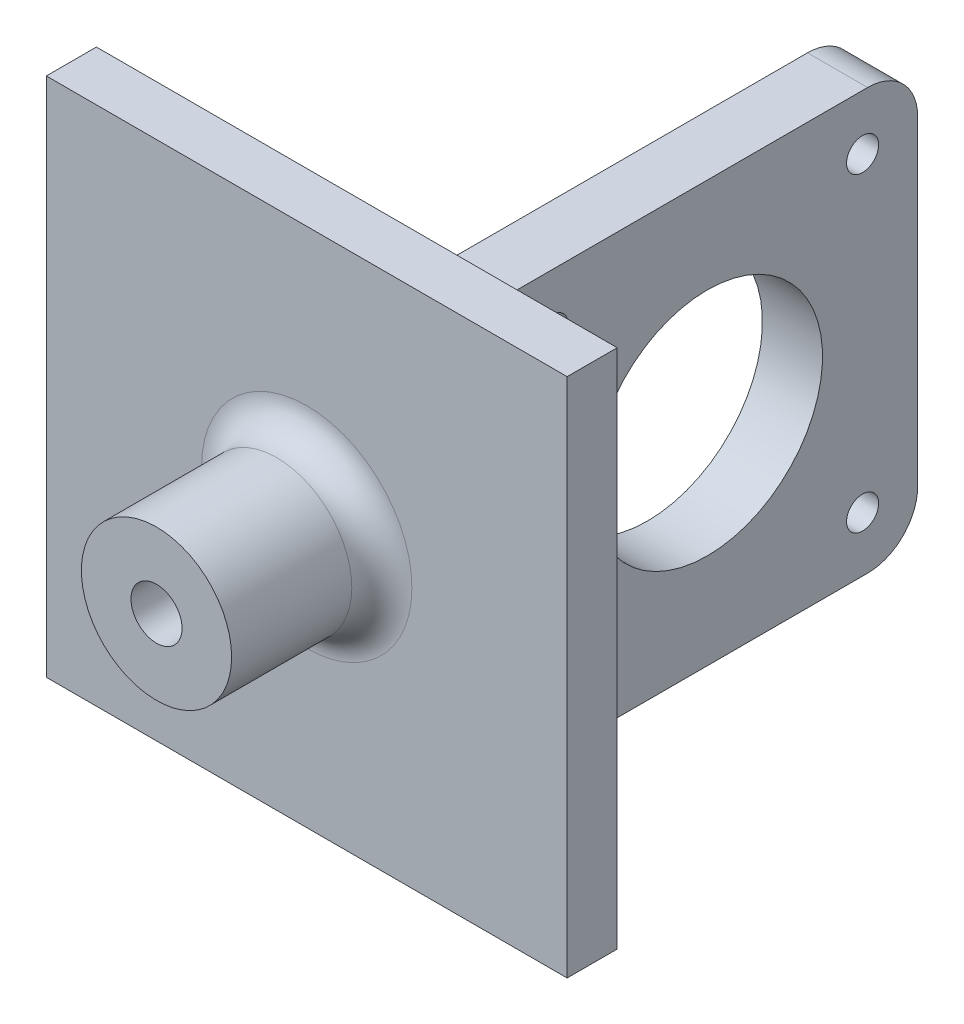
ISO-10303-21;
HEADER;
FILE_DESCRIPTION(('STEP AP214'),'2;1');
FILE_NAME('part.step','',(''),(''),'','','');
FILE_SCHEMA(('AUTOMOTIVE_DESIGN { 1 0 10303 214 1 1 1 1 }'));
ENDSEC;
DATA;
#1=APPLICATION_CONTEXT('core data for automotive mechanical design processes');
#2=APPLICATION_PROTOCOL_DEFINITION('international standard','automotive_design',2000,#1);
#3=PRODUCT_CONTEXT('',#1,'mechanical');
#4=PRODUCT('Part','Part','',(#3));
#5=PRODUCT_RELATED_PRODUCT_CATEGORY('part','',(#4));
#6=PRODUCT_DEFINITION_FORMATION('','',#4);
#7=PRODUCT_DEFINITION_CONTEXT('part definition',#1,'design');
#8=PRODUCT_DEFINITION('design','',#6,#7);
#9=PRODUCT_DEFINITION_SHAPE('','',#8);
#10=(LENGTH_UNIT() NAMED_UNIT(*) SI_UNIT(.MILLI.,.METRE.));
#11=(NAMED_UNIT(*) PLANE_ANGLE_UNIT() SI_UNIT($,.RADIAN.));
#12=(NAMED_UNIT(*) SI_UNIT($,.STERADIAN.) SOLID_ANGLE_UNIT());
#13=UNCERTAINTY_MEASURE_WITH_UNIT(LENGTH_MEASURE(1.E-05),#10,'distance_accuracy_value','');
#14=(GEOMETRIC_REPRESENTATION_CONTEXT(3) GLOBAL_UNCERTAINTY_ASSIGNED_CONTEXT((#13)) GLOBAL_UNIT_ASSIGNED_CONTEXT((#10,
#11,#12)) REPRESENTATION_CONTEXT('',''));
#15=CARTESIAN_POINT('',(0.,0.,0.));
#16=DIRECTION('',(0.,0.,1.));
#17=DIRECTION('',(1.,0.,0.));
#18=AXIS2_PLACEMENT_3D('',#15,#16,#17);
#19=CARTESIAN_POINT('',(-2.03890050108032,7.88491467487254,0.));
#20=DIRECTION('',(0.,0.,1.));
#21=DIRECTION('',(1.,0.,0.));
#22=AXIS2_PLACEMENT_3D('',#19,#20,#21);
#23=PLANE('',#22);
#24=DIRECTION('',(1.,0.,0.));
#25=VECTOR('',#24,1.);
#26=CARTESIAN_POINT('',(2.96109949891969,31.8849146748725,0.));
#27=LINE('',#26,#25);
#28=CARTESIAN_POINT('',(11.9610994989197,31.8849146748725,0.));
#29=VERTEX_POINT('',#28);
#30=CARTESIAN_POINT('',(-0.0389005010803124,31.8849146748725,0.));
#31=VERTEX_POINT('',#30);
#32=EDGE_CURVE('E316',#29,#31,#27,.F.);
#33=ORIENTED_EDGE('',*,*,#32,.T.);
#34=DIRECTION('',(0.,1.,0.));
#35=VECTOR('',#34,1.);
#36=CARTESIAN_POINT('',(-0.038900501080318,-13.1150853251275,0.));
#37=LINE('',#36,#35);
#38=CARTESIAN_POINT('',(-0.0389005010803184,-16.1150853251275,0.));
#39=VERTEX_POINT('',#38);
#40=EDGE_CURVE('E325',#31,#39,#37,.F.);
#41=ORIENTED_EDGE('',*,*,#40,.T.);
#42=DIRECTION('',(-1.,0.,0.));
#43=VECTOR('',#42,1.);
#44=CARTESIAN_POINT('',(8.96109949891968,-16.1150853251275,0.));
#45=LINE('',#44,#43);
#46=CARTESIAN_POINT('',(11.9610994989197,-16.1150853251275,0.));
#47=VERTEX_POINT('',#46);
#48=EDGE_CURVE('E303',#39,#47,#45,.F.);
#49=ORIENTED_EDGE('',*,*,#48,.T.);
#50=DIRECTION('',(0.,-1.,0.));
#51=VECTOR('',#50,1.);
#52=CARTESIAN_POINT('',(11.9610994989197,28.8849146748725,0.));
#53=LINE('',#52,#51);
#54=EDGE_CURVE('E308',#47,#29,#53,.F.);
#55=ORIENTED_EDGE('',*,*,#54,.T.);
#56=EDGE_LOOP('',(#33,#41,#49,#55));
#57=FACE_BOUND('',#56,.T.);
#58=DIRECTION('',(-1.,0.,0.));
#59=VECTOR('',#58,1.);
#60=CARTESIAN_POINT('',(23.9610994989197,-18.1150853251275,0.));
#61=LINE('',#60,#59);
#62=CARTESIAN_POINT('',(23.9610994989197,-18.1150853251275,0.));
#63=VERTEX_POINT('',#62);
#64=CARTESIAN_POINT('',(-28.0389005010803,-18.1150853251275,0.));
#65=VERTEX_POINT('',#64);
#66=EDGE_CURVE('E191',#63,#65,#61,.T.);
#67=ORIENTED_EDGE('',*,*,#66,.T.);
#68=DIRECTION('',(0.,-1.,0.));
#69=VECTOR('',#68,1.);
#70=CARTESIAN_POINT('',(-28.0389005010803,33.8849146748725,0.));
#71=LINE('',#70,#69);
#72=CARTESIAN_POINT('',(-28.0389005010803,33.8849146748725,0.));
#73=VERTEX_POINT('',#72);
#74=EDGE_CURVE('E195',#73,#65,#71,.T.);
#75=ORIENTED_EDGE('',*,*,#74,.F.);
#76=DIRECTION('',(-1.,0.,0.));
#77=VECTOR('',#76,1.);
#78=CARTESIAN_POINT('',(23.9610994989197,33.8849146748725,0.));
#79=LINE('',#78,#77);
#80=CARTESIAN_POINT('',(23.9610994989197,33.8849146748725,0.));
#81=VERTEX_POINT('',#80);
#82=EDGE_CURVE('E200',#81,#73,#79,.T.);
#83=ORIENTED_EDGE('',*,*,#82,.F.);
#84=DIRECTION('',(0.,-1.,0.));
#85=VECTOR('',#84,1.);
#86=CARTESIAN_POINT('',(23.9610994989197,33.8849146748725,0.));
#87=LINE('',#86,#85);
#88=EDGE_CURVE('E165',#81,#63,#87,.T.);
#89=ORIENTED_EDGE('',*,*,#88,.T.);
#90=EDGE_LOOP('',(#67,#75,#83,#89));
#91=FACE_BOUND('',#90,.T.);
#92=ADVANCED_FACE('F65',(#57,#91),#23,.F.);
#93=CARTESIAN_POINT('',(-2.03890050108032,7.88491467487254,5.));
#94=DIRECTION('',(0.,0.,1.));
#95=DIRECTION('',(1.,0.,0.));
#96=AXIS2_PLACEMENT_3D('',#93,#94,#95);
#97=PLANE('',#96);
#98=CARTESIAN_POINT('',(-2.03890050108032,7.88491467487254,5.));
#99=DIRECTION('',(0.,0.,1.));
#100=DIRECTION('',(1.,0.,0.));
#101=AXIS2_PLACEMENT_3D('',#98,#99,#100);
#102=CIRCLE('',#101,10.5);
#103=CARTESIAN_POINT('',(8.46109949891968,7.88491467487254,5.));
#104=VERTEX_POINT('',#103);
#105=EDGE_CURVE('E334',#104,#104,#102,.F.);
#106=ORIENTED_EDGE('',*,*,#105,.T.);
#107=EDGE_LOOP('',(#106));
#108=FACE_BOUND('',#107,.T.);
#109=DIRECTION('',(0.,-1.,0.));
#110=VECTOR('',#109,1.);
#111=CARTESIAN_POINT('',(-28.0389005010803,33.8849146748725,5.));
#112=LINE('',#111,#110);
#113=CARTESIAN_POINT('',(-28.0389005010803,33.8849146748725,5.));
#114=VERTEX_POINT('',#113);
#115=CARTESIAN_POINT('',(-28.0389005010803,-18.1150853251275,5.));
#116=VERTEX_POINT('',#115);
#117=EDGE_CURVE('E180',#114,#116,#112,.T.);
#118=ORIENTED_EDGE('',*,*,#117,.T.);
#119=DIRECTION('',(-1.,0.,0.));
#120=VECTOR('',#119,1.);
#121=CARTESIAN_POINT('',(23.9610994989197,-18.1150853251275,5.));
#122=LINE('',#121,#120);
#123=CARTESIAN_POINT('',(23.9610994989197,-18.1150853251275,5.));
#124=VERTEX_POINT('',#123);
#125=EDGE_CURVE('E183',#124,#116,#122,.T.);
#126=ORIENTED_EDGE('',*,*,#125,.F.);
#127=DIRECTION('',(0.,-1.,0.));
#128=VECTOR('',#127,1.);
#129=CARTESIAN_POINT('',(23.9610994989197,33.8849146748725,5.));
#130=LINE('',#129,#128);
#131=CARTESIAN_POINT('',(23.9610994989197,33.8849146748725,5.));
#132=VERTEX_POINT('',#131);
#133=EDGE_CURVE('E162',#132,#124,#130,.T.);
#134=ORIENTED_EDGE('',*,*,#133,.F.);
#135=DIRECTION('',(-1.,0.,0.));
#136=VECTOR('',#135,1.);
#137=CARTESIAN_POINT('',(23.9610994989197,33.8849146748725,5.));
#138=LINE('',#137,#136);
#139=EDGE_CURVE('E173',#132,#114,#138,.T.);
#140=ORIENTED_EDGE('',*,*,#139,.T.);
#141=EDGE_LOOP('',(#118,#126,#134,#140));
#142=FACE_BOUND('',#141,.T.);
#143=ADVANCED_FACE('F182',(#108,#142),#97,.T.);
#144=CARTESIAN_POINT('',(-2.03890050108032,7.88491467487254,20.));
#145=DIRECTION('',(0.,0.,1.));
#146=DIRECTION('',(1.,0.,0.));
#147=AXIS2_PLACEMENT_3D('',#144,#145,#146);
#148=PLANE('',#147);
#149=CARTESIAN_POINT('',(-2.03890050108032,7.88491467487254,20.));
#150=DIRECTION('',(0.,0.,1.));
#151=DIRECTION('',(1.,0.,0.));
#152=AXIS2_PLACEMENT_3D('',#149,#150,#151);
#153=CIRCLE('',#152,7.5);
#154=CARTESIAN_POINT('',(5.46109949891968,7.88491467487254,20.));
#155=VERTEX_POINT('',#154);
#156=EDGE_CURVE('E218',#155,#155,#153,.T.);
#157=ORIENTED_EDGE('',*,*,#156,.T.);
#158=EDGE_LOOP('',(#157));
#159=FACE_BOUND('',#158,.T.);
#160=CARTESIAN_POINT('',(-2.03890050108032,7.88491467487254,20.));
#161=DIRECTION('',(0.,0.,1.));
#162=DIRECTION('',(1.,0.,0.));
#163=AXIS2_PLACEMENT_3D('',#160,#161,#162);
#164=CIRCLE('',#163,2.55);
#165=CARTESIAN_POINT('',(0.511099498919682,7.88491467487254,20.));
#166=VERTEX_POINT('',#165);
#167=EDGE_CURVE('E214',#166,#166,#164,.T.);
#168=ORIENTED_EDGE('',*,*,#167,.F.);
#169=EDGE_LOOP('',(#168));
#170=FACE_BOUND('',#169,.T.);
#171=ADVANCED_FACE('F253',(#159,#170),#148,.T.);
#172=CARTESIAN_POINT('',(-2.03890050108032,7.88491467487254,20.));
#173=DIRECTION('',(0.,0.,-1.));
#174=DIRECTION('',(-1.,0.,0.));
#175=AXIS2_PLACEMENT_3D('',#172,#173,#174);
#176=CYLINDRICAL_SURFACE('',#175,7.5);
#177=CARTESIAN_POINT('',(-2.03890050108032,7.88491467487254,8.));
#178=DIRECTION('',(0.,0.,1.));
#179=DIRECTION('',(1.,0.,0.));
#180=AXIS2_PLACEMENT_3D('',#177,#178,#179);
#181=CIRCLE('',#180,7.5);
#182=CARTESIAN_POINT('',(5.46109949891968,7.88491467487254,8.));
#183=VERTEX_POINT('',#182);
#184=EDGE_CURVE('E330',#183,#183,#181,.T.);
#185=ORIENTED_EDGE('',*,*,#184,.T.);
#186=EDGE_LOOP('',(#185));
#187=FACE_BOUND('',#186,.T.);
#188=CARTESIAN_POINT('',(-9.53890050108032,7.88491467487254,14.1));
#189=CARTESIAN_POINT('',(-9.53889885814012,7.79612024553868,14.0999968941954));
#190=CARTESIAN_POINT('',(-9.5373075390887,7.70728778517185,14.0925833655204));
#191=CARTESIAN_POINT('',(-9.53111309090071,7.53214246988026,14.063153761428));
#192=CARTESIAN_POINT('',(-9.5265077382763,7.44583152424977,14.0411269054233));
#193=CARTESIAN_POINT('',(-9.5147984340278,7.27828609469188,13.9831890480461));
#194=CARTESIAN_POINT('',(-9.50769702918688,7.19704653542728,13.9472921948786));
#195=CARTESIAN_POINT('',(-9.4917637024154,7.04174691714546,13.8626773923973));
#196=CARTESIAN_POINT('',(-9.48293184238412,6.96768660146462,13.8139599016631));
#197=CARTESIAN_POINT('',(-9.46435530890554,6.82771048118326,13.7042971695346));
#198=CARTESIAN_POINT('',(-9.45459977618456,6.76192032944168,13.643193366897));
#199=CARTESIAN_POINT('',(-9.4353526520736,6.64144115964631,13.510833063914));
#200=CARTESIAN_POINT('',(-9.42586108337853,6.58675309358911,13.4395756937978));
#201=CARTESIAN_POINT('',(-9.40810981059592,6.48948189720066,13.2880094049401));
#202=CARTESIAN_POINT('',(-9.39986403913577,6.4470314498449,13.2076135566835));
#203=CARTESIAN_POINT('',(-9.38569337633961,6.37629127386201,13.0406246831015));
#204=CARTESIAN_POINT('',(-9.37976822198385,6.3479999403338,12.9540323614034));
#205=CARTESIAN_POINT('',(-9.37102005213317,6.30679417951383,12.7784683808897));
#206=CARTESIAN_POINT('',(-9.36815232155054,6.29365786781298,12.689551074592));
#207=CARTESIAN_POINT('',(-9.36570931511636,6.28244533397324,12.5107319558493));
#208=CARTESIAN_POINT('',(-9.36613365492443,6.28436735381479,12.4208302595528));
#209=CARTESIAN_POINT('',(-9.37018631877327,6.30303811678568,12.2442360444831));
#210=CARTESIAN_POINT('',(-9.37375915951708,6.31953011843447,12.1575149158877));
#211=CARTESIAN_POINT('',(-9.38361864170533,6.36646638652421,11.9880993483017));
#212=CARTESIAN_POINT('',(-9.38990542872851,6.39691140142391,11.9054051255831));
#213=CARTESIAN_POINT('',(-9.40453972287785,6.47112799253451,11.7456636265598));
#214=CARTESIAN_POINT('',(-9.41290254307853,6.51499918850686,11.6686640952086));
#215=CARTESIAN_POINT('',(-9.43073710472244,6.61475268270003,11.5230242867712));
#216=CARTESIAN_POINT('',(-9.4402089902588,6.67063654243252,11.4543850982549));
#217=CARTESIAN_POINT('',(-9.45943318599982,6.79419270735712,11.3259352460815));
#218=CARTESIAN_POINT('',(-9.46918725998545,6.86208357315171,11.2663348821362));
#219=CARTESIAN_POINT('',(-9.48769933184801,7.00700591617073,11.1593325863125));
#220=CARTESIAN_POINT('',(-9.49645731334425,7.08403754367204,11.1119308550241));
#221=CARTESIAN_POINT('',(-9.51201670049652,7.24530459304527,11.0306233249926));
#222=CARTESIAN_POINT('',(-9.51881425546771,7.32955377654599,10.996744037718));
#223=CARTESIAN_POINT('',(-9.52965810908774,7.50272612755312,10.9436806587957));
#224=CARTESIAN_POINT('',(-9.53370478790243,7.59164864738275,10.9244945365341));
#225=CARTESIAN_POINT('',(-9.53853717251384,7.7698386283208,10.9016655698161));
#226=CARTESIAN_POINT('',(-9.53938317227586,7.85906767821333,10.897735300314));
#227=CARTESIAN_POINT('',(-9.53788739600825,8.03690736140054,10.9047520312125));
#228=CARTESIAN_POINT('',(-9.53554582513235,8.12551803412538,10.9156980741656));
#229=CARTESIAN_POINT('',(-9.52797596447872,8.29866073725279,10.9519182252163));
#230=CARTESIAN_POINT('',(-9.52277786695396,8.38322553820784,10.9770425485252));
#231=CARTESIAN_POINT('',(-9.51007637641655,8.54694107066552,11.0407405838802));
#232=CARTESIAN_POINT('',(-9.50257279373094,8.62609135605901,11.0793154025379));
#233=CARTESIAN_POINT('',(-9.4859434419335,8.77792662564554,11.1694250746182));
#234=CARTESIAN_POINT('',(-9.47679688267164,8.85050833461102,11.2211300265148));
#235=CARTESIAN_POINT('',(-9.45794040977578,8.98606823490302,11.3358071560302));
#236=CARTESIAN_POINT('',(-9.44823042688405,9.04904524212385,11.3987807208118));
#237=CARTESIAN_POINT('',(-9.42913469923058,9.16473645048655,11.5355234396277));
#238=CARTESIAN_POINT('',(-9.41975758397859,9.21725211019977,11.6094619934081));
#239=CARTESIAN_POINT('',(-9.40258368846447,9.30912076792726,11.7652787115116));
#240=CARTESIAN_POINT('',(-9.39478684107546,9.3484743250897,11.8471565383705));
#241=CARTESIAN_POINT('',(-9.38172831276012,9.41264274715485,12.0160945750566));
#242=CARTESIAN_POINT('',(-9.37645268740554,9.43753774856198,12.1031232157705));
#243=CARTESIAN_POINT('',(-9.3690073913784,9.47231982366351,12.2802547258797));
#244=CARTESIAN_POINT('',(-9.36683725169576,9.48220916362136,12.370357128951));
#245=CARTESIAN_POINT('',(-9.36587716265761,9.48660642349873,12.5490792572769));
#246=CARTESIAN_POINT('',(-9.36701810679612,9.48142880369297,12.6376910205562));
#247=CARTESIAN_POINT('',(-9.3723958992409,9.45653945492962,12.8127486025521));
#248=CARTESIAN_POINT('',(-9.37663271467961,9.43682788027285,12.8991944442534));
#249=CARTESIAN_POINT('',(-9.38769199446598,9.38357870248988,13.0672312446234));
#250=CARTESIAN_POINT('',(-9.39450629311623,9.3500847340701,13.1488366035343));
#251=CARTESIAN_POINT('',(-9.40995634544365,9.27025984179099,13.3053170836913));
#252=CARTESIAN_POINT('',(-9.41859227810757,9.22392765635745,13.3801915425531));
#253=CARTESIAN_POINT('',(-9.43692047310325,9.1186893247517,13.5226396774495));
#254=CARTESIAN_POINT('',(-9.44662987812015,9.05955817220906,13.5900449482534));
#255=CARTESIAN_POINT('',(-9.46589355544894,8.93085902294704,13.7140795321431));
#256=CARTESIAN_POINT('',(-9.47544779146988,8.86128862256699,13.7707063566373));
#257=CARTESIAN_POINT('',(-9.49346277237312,8.71266286884099,13.8722360394568));
#258=CARTESIAN_POINT('',(-9.50190874173824,8.63350207837368,13.9169873098911));
#259=CARTESIAN_POINT('',(-9.51660824821489,8.4686207149017,13.9924789985566));
#260=CARTESIAN_POINT('',(-9.522863664088,8.38290584037073,14.0232314299291));
#261=CARTESIAN_POINT('',(-9.53133149620023,8.22837943797645,14.0642297629138));
#262=CARTESIAN_POINT('',(-9.53415258342062,8.1604175105222,14.0776185146513));
#263=CARTESIAN_POINT('',(-9.53793768855796,8.02328294615243,14.0955046639985));
#264=CARTESIAN_POINT('',(-9.53890178139002,7.95411035819113,14.1000024202901));
#265=CARTESIAN_POINT('',(-9.53890050108032,7.88491467487254,14.1));
#266=B_SPLINE_CURVE_WITH_KNOTS('',3,(#188,#189,#190,#191,#192,#193,#194,#195,#196,#197,#198,
#199,#200,#201,#202,#203,#204,#205,#206,#207,#208,#209,#210,#211,#212,#213,#214,#215,#216,#217,
#218,#219,#220,#221,#222,#223,#224,#225,#226,#227,#228,#229,#230,#231,#232,#233,#234,#235,#236,
#237,#238,#239,#240,#241,#242,#243,#244,#245,#246,#247,#248,#249,#250,#251,#252,#253,#254,#255,
#256,#257,#258,#259,#260,#261,#262,#263,#264,#265),.UNSPECIFIED.,.T.,.F.,(4,2,2,2,2,2,2,2,2,2,2,
2,2,2,2,2,2,2,2,2,2,2,2,2,2,2,2,2,2,2,2,2,2,2,2,2,2,2,4),(0.,0.266130047854765,
0.532456644597193,0.798512286868046,1.0645584139285,1.33425388789939,1.60397247832158,
1.87651399120587,2.14902460517277,2.41749263134366,2.68592931506412,2.94972810159234,
3.21354104030559,3.47936093436643,3.74521540295248,4.01653060252533,4.28785026321979,
4.55969927797482,4.83151071607126,5.09817555204362,5.36482322613615,5.62870529395039,
5.89260907723844,6.16012360036749,6.42767107713311,6.69989324302714,6.97210384299804,
7.24279095265699,7.51343717712195,7.77847555890146,8.04351112692156,8.30771397733336,
8.57194279940305,8.8412611265422,9.11064156026671,9.38331104903346,9.65574610257702,
9.86314417471904,10.0705338798061),.UNSPECIFIED.);
#267=CARTESIAN_POINT('',(-9.53890050108032,7.88491467487254,14.1));
#268=VERTEX_POINT('',#267);
#269=EDGE_CURVE('E213',#268,#268,#266,.T.);
#270=ORIENTED_EDGE('',*,*,#269,.T.);
#271=EDGE_LOOP('',(#270));
#272=FACE_BOUND('',#271,.T.);
#273=ORIENTED_EDGE('',*,*,#156,.F.);
#274=EDGE_LOOP('',(#273));
#275=FACE_BOUND('',#274,.T.);
#276=ADVANCED_FACE('F237',(#187,#272,#275),#176,.T.);
#277=CARTESIAN_POINT('',(-2.03890050108032,7.88491467487254,20.));
#278=DIRECTION('',(0.,0.,-1.));
#279=DIRECTION('',(-1.,0.,0.));
#280=AXIS2_PLACEMENT_3D('',#277,#278,#279);
#281=CYLINDRICAL_SURFACE('',#280,2.55);
#282=ORIENTED_EDGE('',*,*,#167,.T.);
#283=EDGE_LOOP('',(#282));
#284=FACE_BOUND('',#283,.T.);
#285=CARTESIAN_POINT('',(-2.03890050108032,7.88491467487254,5.));
#286=DIRECTION('',(0.,0.,1.));
#287=DIRECTION('',(1.,0.,0.));
#288=AXIS2_PLACEMENT_3D('',#285,#286,#287);
#289=CIRCLE('',#288,2.55);
#290=CARTESIAN_POINT('',(0.511099498919682,7.88491467487254,5.));
#291=VERTEX_POINT('',#290);
#292=EDGE_CURVE('E219',#291,#291,#289,.T.);
#293=ORIENTED_EDGE('',*,*,#292,.F.);
#294=EDGE_LOOP('',(#293));
#295=FACE_BOUND('',#294,.T.);
#296=ADVANCED_FACE('F250',(#284,#295),#281,.F.);
#297=ORIENTED_EDGE('',*,*,#292,.T.);
#298=EDGE_LOOP('',(#297));
#299=FACE_BOUND('',#298,.T.);
#300=ADVANCED_FACE('F247',(#299),#97,.T.);
#301=CARTESIAN_POINT('',(-8.03890050108032,7.88491467487254,12.5));
#302=DIRECTION('',(-1.,0.,0.));
#303=DIRECTION('',(0.,0.,1.));
#304=AXIS2_PLACEMENT_3D('',#301,#302,#303);
#305=CYLINDRICAL_SURFACE('',#304,1.6);
#306=CARTESIAN_POINT('',(-8.03890050108032,7.88491467487254,12.5));
#307=DIRECTION('',(-1.,0.,0.));
#308=DIRECTION('',(0.,0.,1.));
#309=AXIS2_PLACEMENT_3D('',#306,#307,#308);
#310=CIRCLE('',#309,1.6);
#311=CARTESIAN_POINT('',(-8.03890050108032,7.88491467487254,14.1));
#312=VERTEX_POINT('',#311);
#313=EDGE_CURVE('E206',#312,#312,#310,.T.);
#314=ORIENTED_EDGE('',*,*,#313,.F.);
#315=EDGE_LOOP('',(#314));
#316=FACE_BOUND('',#315,.T.);
#317=ORIENTED_EDGE('',*,*,#269,.F.);
#318=EDGE_LOOP('',(#317));
#319=FACE_BOUND('',#318,.T.);
#320=ADVANCED_FACE('F241',(#316,#319),#305,.F.);
#321=CARTESIAN_POINT('',(-8.03890050108032,7.88491467487254,12.5));
#322=DIRECTION('',(-1.,0.,0.));
#323=DIRECTION('',(0.,0.,1.));
#324=AXIS2_PLACEMENT_3D('',#321,#322,#323);
#325=PLANE('',#324);
#326=ORIENTED_EDGE('',*,*,#313,.T.);
#327=EDGE_LOOP('',(#326));
#328=FACE_BOUND('',#327,.T.);
#329=ADVANCED_FACE('F246',(#328),#325,.T.);
#330=CARTESIAN_POINT('',(23.9610994989197,-18.1150853251275,5.));
#331=DIRECTION('',(0.,-1.,0.));
#332=DIRECTION('',(0.,0.,-1.));
#333=AXIS2_PLACEMENT_3D('',#330,#331,#332);
#334=PLANE('',#333);
#335=ORIENTED_EDGE('',*,*,#66,.F.);
#336=DIRECTION('',(0.,0.,-1.));
#337=VECTOR('',#336,1.);
#338=CARTESIAN_POINT('',(23.9610994989197,-18.1150853251275,5.));
#339=LINE('',#338,#337);
#340=EDGE_CURVE('E169',#124,#63,#339,.T.);
#341=ORIENTED_EDGE('',*,*,#340,.F.);
#342=ORIENTED_EDGE('',*,*,#125,.T.);
#343=DIRECTION('',(0.,0.,-1.));
#344=VECTOR('',#343,1.);
#345=CARTESIAN_POINT('',(-28.0389005010803,-18.1150853251275,5.));
#346=LINE('',#345,#344);
#347=EDGE_CURVE('E185',#116,#65,#346,.T.);
#348=ORIENTED_EDGE('',*,*,#347,.T.);
#349=EDGE_LOOP('',(#335,#341,#342,#348));
#350=FACE_BOUND('',#349,.T.);
#351=ADVANCED_FACE('F400',(#350),#334,.T.);
#352=CARTESIAN_POINT('',(23.9610994989197,33.8849146748725,5.));
#353=DIRECTION('',(1.,0.,0.));
#354=DIRECTION('',(0.,1.,0.));
#355=AXIS2_PLACEMENT_3D('',#352,#353,#354);
#356=PLANE('',#355);
#357=ORIENTED_EDGE('',*,*,#88,.F.);
#358=DIRECTION('',(0.,0.,-1.));
#359=VECTOR('',#358,1.);
#360=CARTESIAN_POINT('',(23.9610994989197,33.8849146748725,5.));
#361=LINE('',#360,#359);
#362=EDGE_CURVE('E158',#132,#81,#361,.T.);
#363=ORIENTED_EDGE('',*,*,#362,.F.);
#364=ORIENTED_EDGE('',*,*,#133,.T.);
#365=ORIENTED_EDGE('',*,*,#340,.T.);
#366=EDGE_LOOP('',(#357,#363,#364,#365));
#367=FACE_BOUND('',#366,.T.);
#368=ADVANCED_FACE('F160',(#367),#356,.T.);
#369=CARTESIAN_POINT('',(23.9610994989197,33.8849146748725,5.));
#370=DIRECTION('',(0.,-1.,0.));
#371=DIRECTION('',(0.,0.,-1.));
#372=AXIS2_PLACEMENT_3D('',#369,#370,#371);
#373=PLANE('',#372);
#374=ORIENTED_EDGE('',*,*,#82,.T.);
#375=DIRECTION('',(0.,0.,-1.));
#376=VECTOR('',#375,1.);
#377=CARTESIAN_POINT('',(-28.0389005010803,33.8849146748725,5.));
#378=LINE('',#377,#376);
#379=EDGE_CURVE('E170',#114,#73,#378,.T.);
#380=ORIENTED_EDGE('',*,*,#379,.F.);
#381=ORIENTED_EDGE('',*,*,#139,.F.);
#382=ORIENTED_EDGE('',*,*,#362,.T.);
#383=EDGE_LOOP('',(#374,#380,#381,#382));
#384=FACE_BOUND('',#383,.T.);
#385=ADVANCED_FACE('F174',(#384),#373,.F.);
#386=CARTESIAN_POINT('',(-28.0389005010803,33.8849146748725,5.));
#387=DIRECTION('',(1.,0.,0.));
#388=DIRECTION('',(0.,0.,-1.));
#389=AXIS2_PLACEMENT_3D('',#386,#387,#388);
#390=PLANE('',#389);
#391=ORIENTED_EDGE('',*,*,#74,.T.);
#392=ORIENTED_EDGE('',*,*,#347,.F.);
#393=ORIENTED_EDGE('',*,*,#117,.F.);
#394=ORIENTED_EDGE('',*,*,#379,.T.);
#395=EDGE_LOOP('',(#391,#392,#393,#394));
#396=FACE_BOUND('',#395,.T.);
#397=ADVANCED_FACE('F396',(#396),#390,.F.);
#398=CARTESIAN_POINT('',(8.96109949891969,28.8849146748725,-45.));
#399=DIRECTION('',(-1.,0.,0.));
#400=DIRECTION('',(0.,-1.,0.));
#401=AXIS2_PLACEMENT_3D('',#398,#399,#400);
#402=PLANE('',#401);
#403=CARTESIAN_POINT('',(8.96109949891969,23.3849146748725,-39.5));
#404=DIRECTION('',(1.,0.,0.));
#405=DIRECTION('',(0.,1.,0.));
#406=AXIS2_PLACEMENT_3D('',#403,#404,#405);
#407=CIRCLE('',#406,1.6);
#408=CARTESIAN_POINT('',(8.96109949891969,24.9849146748725,-39.5));
#409=VERTEX_POINT('',#408);
#410=EDGE_CURVE('E360',#409,#409,#407,.T.);
#411=ORIENTED_EDGE('',*,*,#410,.F.);
#412=EDGE_LOOP('',(#411));
#413=FACE_BOUND('',#412,.T.);
#414=CARTESIAN_POINT('',(8.96109949891968,-7.61508532512746,-8.49999999999999));
#415=DIRECTION('',(1.,0.,0.));
#416=DIRECTION('',(0.,1.,0.));
#417=AXIS2_PLACEMENT_3D('',#414,#415,#416);
#418=CIRCLE('',#417,1.6);
#419=CARTESIAN_POINT('',(8.96109949891968,-6.01508532512746,-8.49999999999999));
#420=VERTEX_POINT('',#419);
#421=EDGE_CURVE('E357',#420,#420,#418,.T.);
#422=ORIENTED_EDGE('',*,*,#421,.F.);
#423=EDGE_LOOP('',(#422));
#424=FACE_BOUND('',#423,.T.);
#425=CARTESIAN_POINT('',(8.96109949891968,-7.61508532512747,-39.5));
#426=DIRECTION('',(1.,0.,0.));
#427=DIRECTION('',(0.,1.,0.));
#428=AXIS2_PLACEMENT_3D('',#425,#426,#427);
#429=CIRCLE('',#428,1.6);
#430=CARTESIAN_POINT('',(8.96109949891968,-6.01508532512747,-39.5));
#431=VERTEX_POINT('',#430);
#432=EDGE_CURVE('E351',#431,#431,#429,.T.);
#433=ORIENTED_EDGE('',*,*,#432,.F.);
#434=EDGE_LOOP('',(#433));
#435=FACE_BOUND('',#434,.T.);
#436=CARTESIAN_POINT('',(8.96109949891969,23.3849146748725,-8.49999999999999));
#437=DIRECTION('',(1.,0.,0.));
#438=DIRECTION('',(0.,1.,0.));
#439=AXIS2_PLACEMENT_3D('',#436,#437,#438);
#440=CIRCLE('',#439,1.6);
#441=CARTESIAN_POINT('',(8.96109949891969,24.9849146748725,-8.49999999999999));
#442=VERTEX_POINT('',#441);
#443=EDGE_CURVE('E348',#442,#442,#440,.T.);
#444=ORIENTED_EDGE('',*,*,#443,.F.);
#445=EDGE_LOOP('',(#444));
#446=FACE_BOUND('',#445,.T.);
#447=CARTESIAN_POINT('',(8.96109949891969,7.88491467487253,-24.));
#448=DIRECTION('',(1.,0.,0.));
#449=DIRECTION('',(0.,1.,0.));
#450=AXIS2_PLACEMENT_3D('',#447,#448,#449);
#451=CIRCLE('',#450,11.5);
#452=CARTESIAN_POINT('',(8.96109949891969,19.3849146748725,-24.));
#453=VERTEX_POINT('',#452);
#454=EDGE_CURVE('E364',#453,#453,#451,.T.);
#455=ORIENTED_EDGE('',*,*,#454,.F.);
#456=EDGE_LOOP('',(#455));
#457=FACE_BOUND('',#456,.T.);
#458=DIRECTION('',(0.,0.,1.));
#459=VECTOR('',#458,1.);
#460=CARTESIAN_POINT('',(8.96109949891969,28.8849146748725,-45.));
#461=LINE('',#460,#459);
#462=CARTESIAN_POINT('',(8.96109949891969,28.8849146748725,-40.));
#463=VERTEX_POINT('',#462);
#464=CARTESIAN_POINT('',(8.96109949891969,28.8849146748725,-3.00000000000002));
#465=VERTEX_POINT('',#464);
#466=EDGE_CURVE('E380',#463,#465,#461,.T.);
#467=ORIENTED_EDGE('',*,*,#466,.T.);
#468=DIRECTION('',(0.,-1.,0.));
#469=VECTOR('',#468,1.);
#470=CARTESIAN_POINT('',(8.96109949891968,-13.1150853251275,-3.));
#471=LINE('',#470,#469);
#472=CARTESIAN_POINT('',(8.96109949891968,-13.1150853251275,-3.00000000000002));
#473=VERTEX_POINT('',#472);
#474=EDGE_CURVE('E12',#465,#473,#471,.T.);
#475=ORIENTED_EDGE('',*,*,#474,.T.);
#476=DIRECTION('',(0.,0.,1.));
#477=VECTOR('',#476,1.);
#478=CARTESIAN_POINT('',(8.96109949891968,-13.1150853251275,-45.));
#479=LINE('',#478,#477);
#480=CARTESIAN_POINT('',(8.96109949891968,-13.1150853251275,-40.));
#481=VERTEX_POINT('',#480);
#482=EDGE_CURVE('E196',#481,#473,#479,.T.);
#483=ORIENTED_EDGE('',*,*,#482,.F.);
#484=CARTESIAN_POINT('',(8.96109949891968,-8.11508532512747,-40.));
#485=DIRECTION('',(-1.,0.,0.));
#486=DIRECTION('',(0.,-1.,0.));
#487=AXIS2_PLACEMENT_3D('',#484,#485,#486);
#488=CIRCLE('',#487,5.);
#489=CARTESIAN_POINT('',(8.96109949891968,-8.11508532512746,-45.));
#490=VERTEX_POINT('',#489);
#491=EDGE_CURVE('E488',#481,#490,#488,.F.);
#492=ORIENTED_EDGE('',*,*,#491,.T.);
#493=DIRECTION('',(0.,-1.,0.));
#494=VECTOR('',#493,1.);
#495=CARTESIAN_POINT('',(8.96109949891969,28.8849146748725,-45.));
#496=LINE('',#495,#494);
#497=CARTESIAN_POINT('',(8.96109949891969,23.8849146748725,-45.));
#498=VERTEX_POINT('',#497);
#499=EDGE_CURVE('E371',#498,#490,#496,.T.);
#500=ORIENTED_EDGE('',*,*,#499,.F.);
#501=CARTESIAN_POINT('',(8.96109949891969,23.8849146748725,-40.));
#502=DIRECTION('',(-1.,0.,0.));
#503=DIRECTION('',(0.,-1.,0.));
#504=AXIS2_PLACEMENT_3D('',#501,#502,#503);
#505=CIRCLE('',#504,5.);
#506=EDGE_CURVE('E485',#498,#463,#505,.F.);
#507=ORIENTED_EDGE('',*,*,#506,.T.);
#508=EDGE_LOOP('',(#467,#475,#483,#492,#500,#507));
#509=FACE_BOUND('',#508,.T.);
#510=ADVANCED_FACE('F411',(#413,#424,#435,#446,#457,#509),#402,.F.);
#511=CARTESIAN_POINT('',(8.96109949891968,-13.1150853251275,-45.));
#512=DIRECTION('',(0.,1.,0.));
#513=DIRECTION('',(0.,0.,1.));
#514=AXIS2_PLACEMENT_3D('',#511,#512,#513);
#515=PLANE('',#514);
#516=ORIENTED_EDGE('',*,*,#482,.T.);
#517=DIRECTION('',(-1.,0.,0.));
#518=VECTOR('',#517,1.);
#519=CARTESIAN_POINT('',(2.96109949891968,-13.1150853251275,-3.));
#520=LINE('',#519,#518);
#521=CARTESIAN_POINT('',(2.96109949891968,-13.1150853251275,-3.00000000000002));
#522=VERTEX_POINT('',#521);
#523=EDGE_CURVE('E88',#473,#522,#520,.T.);
#524=ORIENTED_EDGE('',*,*,#523,.T.);
#525=DIRECTION('',(0.,0.,1.));
#526=VECTOR('',#525,1.);
#527=CARTESIAN_POINT('',(2.96109949891968,-13.1150853251275,-45.));
#528=LINE('',#527,#526);
#529=CARTESIAN_POINT('',(2.96109949891968,-13.1150853251275,-40.));
#530=VERTEX_POINT('',#529);
#531=EDGE_CURVE('E387',#530,#522,#528,.T.);
#532=ORIENTED_EDGE('',*,*,#531,.F.);
#533=DIRECTION('',(-1.,0.,0.));
#534=VECTOR('',#533,1.);
#535=CARTESIAN_POINT('',(8.96109949891968,-13.1150853251275,-40.));
#536=LINE('',#535,#534);
#537=EDGE_CURVE('E482',#530,#481,#536,.F.);
#538=ORIENTED_EDGE('',*,*,#537,.T.);
#539=EDGE_LOOP('',(#516,#524,#532,#538));
#540=FACE_BOUND('',#539,.T.);
#541=ADVANCED_FACE('F416',(#540),#515,.F.);
#542=CARTESIAN_POINT('',(2.96109949891969,28.8849146748725,-45.));
#543=DIRECTION('',(1.,0.,0.));
#544=DIRECTION('',(0.,1.,0.));
#545=AXIS2_PLACEMENT_3D('',#542,#543,#544);
#546=PLANE('',#545);
#547=CARTESIAN_POINT('',(2.96109949891969,23.3849146748725,-39.5));
#548=DIRECTION('',(1.,0.,0.));
#549=DIRECTION('',(0.,1.,0.));
#550=AXIS2_PLACEMENT_3D('',#547,#548,#549);
#551=CIRCLE('',#550,1.6);
#552=CARTESIAN_POINT('',(2.96109949891969,24.9849146748725,-39.5));
#553=VERTEX_POINT('',#552);
#554=EDGE_CURVE('E376',#553,#553,#551,.T.);
#555=ORIENTED_EDGE('',*,*,#554,.T.);
#556=EDGE_LOOP('',(#555));
#557=FACE_BOUND('',#556,.T.);
#558=CARTESIAN_POINT('',(2.96109949891968,-7.61508532512746,-8.49999999999999));
#559=DIRECTION('',(1.,0.,0.));
#560=DIRECTION('',(0.,1.,0.));
#561=AXIS2_PLACEMENT_3D('',#558,#559,#560);
#562=CIRCLE('',#561,1.6);
#563=CARTESIAN_POINT('',(2.96109949891968,-6.01508532512746,-8.49999999999999));
#564=VERTEX_POINT('',#563);
#565=EDGE_CURVE('E457',#564,#564,#562,.T.);
#566=ORIENTED_EDGE('',*,*,#565,.T.);
#567=EDGE_LOOP('',(#566));
#568=FACE_BOUND('',#567,.T.);
#569=CARTESIAN_POINT('',(2.96109949891968,-7.61508532512747,-39.5));
#570=DIRECTION('',(1.,0.,0.));
#571=DIRECTION('',(0.,1.,0.));
#572=AXIS2_PLACEMENT_3D('',#569,#570,#571);
#573=CIRCLE('',#572,1.6);
#574=CARTESIAN_POINT('',(2.96109949891968,-6.01508532512747,-39.5));
#575=VERTEX_POINT('',#574);
#576=EDGE_CURVE('E454',#575,#575,#573,.T.);
#577=ORIENTED_EDGE('',*,*,#576,.T.);
#578=EDGE_LOOP('',(#577));
#579=FACE_BOUND('',#578,.T.);
#580=CARTESIAN_POINT('',(2.96109949891969,23.3849146748725,-8.49999999999999));
#581=DIRECTION('',(1.,0.,0.));
#582=DIRECTION('',(0.,1.,0.));
#583=AXIS2_PLACEMENT_3D('',#580,#581,#582);
#584=CIRCLE('',#583,1.6);
#585=CARTESIAN_POINT('',(2.96109949891969,24.9849146748725,-8.49999999999999));
#586=VERTEX_POINT('',#585);
#587=EDGE_CURVE('E458',#586,#586,#584,.T.);
#588=ORIENTED_EDGE('',*,*,#587,.T.);
#589=EDGE_LOOP('',(#588));
#590=FACE_BOUND('',#589,.T.);
#591=CARTESIAN_POINT('',(2.96109949891968,7.88491467487254,-24.));
#592=DIRECTION('',(1.,0.,0.));
#593=DIRECTION('',(0.,1.,0.));
#594=AXIS2_PLACEMENT_3D('',#591,#592,#593);
#595=CIRCLE('',#594,11.5);
#596=CARTESIAN_POINT('',(2.96109949891969,19.3849146748725,-24.));
#597=VERTEX_POINT('',#596);
#598=EDGE_CURVE('E235',#597,#597,#595,.T.);
#599=ORIENTED_EDGE('',*,*,#598,.T.);
#600=EDGE_LOOP('',(#599));
#601=FACE_BOUND('',#600,.T.);
#602=ORIENTED_EDGE('',*,*,#531,.T.);
#603=DIRECTION('',(0.,1.,0.));
#604=VECTOR('',#603,1.);
#605=CARTESIAN_POINT('',(2.96109949891969,28.8849146748725,-3.));
#606=LINE('',#605,#604);
#607=CARTESIAN_POINT('',(2.96109949891969,28.8849146748725,-3.00000000000002));
#608=VERTEX_POINT('',#607);
#609=EDGE_CURVE('E75',#522,#608,#606,.T.);
#610=ORIENTED_EDGE('',*,*,#609,.T.);
#611=DIRECTION('',(0.,0.,1.));
#612=VECTOR('',#611,1.);
#613=CARTESIAN_POINT('',(2.96109949891969,28.8849146748725,-45.));
#614=LINE('',#613,#612);
#615=CARTESIAN_POINT('',(2.96109949891969,28.8849146748725,-40.));
#616=VERTEX_POINT('',#615);
#617=EDGE_CURVE('E383',#616,#608,#614,.T.);
#618=ORIENTED_EDGE('',*,*,#617,.F.);
#619=CARTESIAN_POINT('',(2.96109949891969,23.8849146748725,-40.));
#620=DIRECTION('',(1.,0.,0.));
#621=DIRECTION('',(0.,1.,0.));
#622=AXIS2_PLACEMENT_3D('',#619,#620,#621);
#623=CIRCLE('',#622,5.);
#624=CARTESIAN_POINT('',(2.96109949891969,23.8849146748725,-45.));
#625=VERTEX_POINT('',#624);
#626=EDGE_CURVE('E476',#616,#625,#623,.F.);
#627=ORIENTED_EDGE('',*,*,#626,.T.);
#628=DIRECTION('',(0.,1.,0.));
#629=VECTOR('',#628,1.);
#630=CARTESIAN_POINT('',(2.96109949891969,28.8849146748725,-45.));
#631=LINE('',#630,#629);
#632=CARTESIAN_POINT('',(2.96109949891968,-8.11508532512746,-45.));
#633=VERTEX_POINT('',#632);
#634=EDGE_CURVE('E375',#633,#625,#631,.T.);
#635=ORIENTED_EDGE('',*,*,#634,.F.);
#636=CARTESIAN_POINT('',(2.96109949891968,-8.11508532512747,-40.));
#637=DIRECTION('',(1.,0.,0.));
#638=DIRECTION('',(0.,1.,0.));
#639=AXIS2_PLACEMENT_3D('',#636,#637,#638);
#640=CIRCLE('',#639,5.);
#641=EDGE_CURVE('E479',#633,#530,#640,.F.);
#642=ORIENTED_EDGE('',*,*,#641,.T.);
#643=EDGE_LOOP('',(#602,#610,#618,#627,#635,#642));
#644=FACE_BOUND('',#643,.T.);
#645=ADVANCED_FACE('F420',(#557,#568,#579,#590,#601,#644),#546,.F.);
#646=CARTESIAN_POINT('',(8.96109949891969,28.8849146748725,-45.));
#647=DIRECTION('',(0.,-1.,0.));
#648=DIRECTION('',(0.,0.,-1.));
#649=AXIS2_PLACEMENT_3D('',#646,#647,#648);
#650=PLANE('',#649);
#651=ORIENTED_EDGE('',*,*,#617,.T.);
#652=DIRECTION('',(1.,0.,0.));
#653=VECTOR('',#652,1.);
#654=CARTESIAN_POINT('',(8.96109949891969,28.8849146748725,-3.));
#655=LINE('',#654,#653);
#656=EDGE_CURVE('E312',#608,#465,#655,.T.);
#657=ORIENTED_EDGE('',*,*,#656,.T.);
#658=ORIENTED_EDGE('',*,*,#466,.F.);
#659=DIRECTION('',(1.,0.,0.));
#660=VECTOR('',#659,1.);
#661=CARTESIAN_POINT('',(2.96109949891969,28.8849146748725,-40.));
#662=LINE('',#661,#660);
#663=EDGE_CURVE('E319',#463,#616,#662,.F.);
#664=ORIENTED_EDGE('',*,*,#663,.T.);
#665=EDGE_LOOP('',(#651,#657,#658,#664));
#666=FACE_BOUND('',#665,.T.);
#667=ADVANCED_FACE('F423',(#666),#650,.F.);
#668=CARTESIAN_POINT('',(0.,0.,-45.));
#669=DIRECTION('',(0.,0.,-1.));
#670=DIRECTION('',(-1.,0.,0.));
#671=AXIS2_PLACEMENT_3D('',#668,#669,#670);
#672=PLANE('',#671);
#673=ORIENTED_EDGE('',*,*,#499,.T.);
#674=DIRECTION('',(-1.,0.,0.));
#675=VECTOR('',#674,1.);
#676=CARTESIAN_POINT('',(2.96109949891968,-8.11508532512747,-45.));
#677=LINE('',#676,#675);
#678=EDGE_CURVE('E472',#490,#633,#677,.T.);
#679=ORIENTED_EDGE('',*,*,#678,.T.);
#680=ORIENTED_EDGE('',*,*,#634,.T.);
#681=DIRECTION('',(1.,0.,0.));
#682=VECTOR('',#681,1.);
#683=CARTESIAN_POINT('',(8.96109949891969,23.8849146748725,-45.));
#684=LINE('',#683,#682);
#685=EDGE_CURVE('E226',#625,#498,#684,.T.);
#686=ORIENTED_EDGE('',*,*,#685,.T.);
#687=EDGE_LOOP('',(#673,#679,#680,#686));
#688=FACE_BOUND('',#687,.T.);
#689=ADVANCED_FACE('F426',(#688),#672,.T.);
#690=CARTESIAN_POINT('',(-1.03890050108031,7.88491467487254,-24.));
#691=DIRECTION('',(1.,0.,0.));
#692=DIRECTION('',(0.,1.,0.));
#693=AXIS2_PLACEMENT_3D('',#690,#691,#692);
#694=CYLINDRICAL_SURFACE('',#693,11.5);
#695=ORIENTED_EDGE('',*,*,#454,.T.);
#696=EDGE_LOOP('',(#695));
#697=FACE_BOUND('',#696,.T.);
#698=ORIENTED_EDGE('',*,*,#598,.F.);
#699=EDGE_LOOP('',(#698));
#700=FACE_BOUND('',#699,.T.);
#701=ADVANCED_FACE('F430',(#697,#700),#694,.F.);
#702=CARTESIAN_POINT('',(-1.03890050108031,23.3849146748725,-8.49999999999999));
#703=DIRECTION('',(1.,0.,0.));
#704=DIRECTION('',(0.,1.,0.));
#705=AXIS2_PLACEMENT_3D('',#702,#703,#704);
#706=CYLINDRICAL_SURFACE('',#705,1.6);
#707=ORIENTED_EDGE('',*,*,#443,.T.);
#708=EDGE_LOOP('',(#707));
#709=FACE_BOUND('',#708,.T.);
#710=ORIENTED_EDGE('',*,*,#587,.F.);
#711=EDGE_LOOP('',(#710));
#712=FACE_BOUND('',#711,.T.);
#713=ADVANCED_FACE('F434',(#709,#712),#706,.F.);
#714=CARTESIAN_POINT('',(-1.03890050108032,-7.61508532512747,-39.5));
#715=DIRECTION('',(1.,0.,0.));
#716=DIRECTION('',(0.,1.,0.));
#717=AXIS2_PLACEMENT_3D('',#714,#715,#716);
#718=CYLINDRICAL_SURFACE('',#717,1.6);
#719=ORIENTED_EDGE('',*,*,#432,.T.);
#720=EDGE_LOOP('',(#719));
#721=FACE_BOUND('',#720,.T.);
#722=ORIENTED_EDGE('',*,*,#576,.F.);
#723=EDGE_LOOP('',(#722));
#724=FACE_BOUND('',#723,.T.);
#725=ADVANCED_FACE('F439',(#721,#724),#718,.F.);
#726=CARTESIAN_POINT('',(-1.03890050108032,-7.61508532512746,-8.49999999999999));
#727=DIRECTION('',(1.,0.,0.));
#728=DIRECTION('',(0.,1.,0.));
#729=AXIS2_PLACEMENT_3D('',#726,#727,#728);
#730=CYLINDRICAL_SURFACE('',#729,1.6);
#731=ORIENTED_EDGE('',*,*,#421,.T.);
#732=EDGE_LOOP('',(#731));
#733=FACE_BOUND('',#732,.T.);
#734=ORIENTED_EDGE('',*,*,#565,.F.);
#735=EDGE_LOOP('',(#734));
#736=FACE_BOUND('',#735,.T.);
#737=ADVANCED_FACE('F436',(#733,#736),#730,.F.);
#738=CARTESIAN_POINT('',(-1.03890050108031,23.3849146748725,-39.5));
#739=DIRECTION('',(1.,0.,0.));
#740=DIRECTION('',(0.,1.,0.));
#741=AXIS2_PLACEMENT_3D('',#738,#739,#740);
#742=CYLINDRICAL_SURFACE('',#741,1.6);
#743=ORIENTED_EDGE('',*,*,#410,.T.);
#744=EDGE_LOOP('',(#743));
#745=FACE_BOUND('',#744,.T.);
#746=ORIENTED_EDGE('',*,*,#554,.F.);
#747=EDGE_LOOP('',(#746));
#748=FACE_BOUND('',#747,.T.);
#749=ADVANCED_FACE('F276',(#745,#748),#742,.F.);
#750=CARTESIAN_POINT('',(0.,-8.11508532512747,-40.));
#751=DIRECTION('',(1.,0.,0.));
#752=DIRECTION('',(0.,0.,-1.));
#753=AXIS2_PLACEMENT_3D('',#750,#751,#752);
#754=CYLINDRICAL_SURFACE('',#753,5.);
#755=ORIENTED_EDGE('',*,*,#491,.F.);
#756=ORIENTED_EDGE('',*,*,#537,.F.);
#757=ORIENTED_EDGE('',*,*,#641,.F.);
#758=ORIENTED_EDGE('',*,*,#678,.F.);
#759=EDGE_LOOP('',(#755,#756,#757,#758));
#760=FACE_BOUND('',#759,.T.);
#761=ADVANCED_FACE('F272',(#760),#754,.T.);
#762=CARTESIAN_POINT('',(0.,23.8849146748725,-40.));
#763=DIRECTION('',(-1.,0.,0.));
#764=DIRECTION('',(0.,0.,1.));
#765=AXIS2_PLACEMENT_3D('',#762,#763,#764);
#766=CYLINDRICAL_SURFACE('',#765,5.);
#767=ORIENTED_EDGE('',*,*,#626,.F.);
#768=ORIENTED_EDGE('',*,*,#663,.F.);
#769=ORIENTED_EDGE('',*,*,#506,.F.);
#770=ORIENTED_EDGE('',*,*,#685,.F.);
#771=EDGE_LOOP('',(#767,#768,#769,#770));
#772=FACE_BOUND('',#771,.T.);
#773=ADVANCED_FACE('F275',(#772),#766,.T.);
#774=CARTESIAN_POINT('',(8.96109949891968,-16.1150853251275,-3.));
#775=DIRECTION('',(1.,0.,0.));
#776=DIRECTION('',(0.,0.,-1.));
#777=AXIS2_PLACEMENT_3D('',#774,#775,#776);
#778=CYLINDRICAL_SURFACE('',#777,3.);
#779=CARTESIAN_POINT('',(11.9610994989197,-16.1150853251275,-3.));
#780=DIRECTION('',(0.707106781186548,0.707106781186547,0.));
#781=DIRECTION('',(-0.707106781186547,0.707106781186548,0.));
#782=AXIS2_PLACEMENT_3D('',#779,#780,#781);
#783=ELLIPSE('',#782,4.24264068711928,3.);
#784=EDGE_CURVE('E300',#47,#473,#783,.F.);
#785=ORIENTED_EDGE('',*,*,#784,.F.);
#786=ORIENTED_EDGE('',*,*,#48,.F.);
#787=CARTESIAN_POINT('',(-0.038900501080318,-16.1150853251275,-3.));
#788=DIRECTION('',(0.707106781186547,-0.707106781186548,0.));
#789=DIRECTION('',(-0.707106781186548,-0.707106781186547,0.));
#790=AXIS2_PLACEMENT_3D('',#787,#788,#789);
#791=ELLIPSE('',#790,4.24264068711929,3.);
#792=EDGE_CURVE('E69',#522,#39,#791,.T.);
#793=ORIENTED_EDGE('',*,*,#792,.F.);
#794=ORIENTED_EDGE('',*,*,#523,.F.);
#795=EDGE_LOOP('',(#785,#786,#793,#794));
#796=FACE_BOUND('',#795,.T.);
#797=ADVANCED_FACE('F279',(#796),#778,.F.);
#798=CARTESIAN_POINT('',(-0.0389005010803128,28.8849146748725,-3.));
#799=DIRECTION('',(0.,-1.,0.));
#800=DIRECTION('',(1.,0.,0.));
#801=AXIS2_PLACEMENT_3D('',#798,#799,#800);
#802=CYLINDRICAL_SURFACE('',#801,3.);
#803=ORIENTED_EDGE('',*,*,#792,.T.);
#804=ORIENTED_EDGE('',*,*,#40,.F.);
#805=CARTESIAN_POINT('',(-0.0389005010803124,31.8849146748725,-3.));
#806=DIRECTION('',(-0.707106781186548,-0.707106781186547,0.));
#807=DIRECTION('',(0.707106781186547,-0.707106781186548,0.));
#808=AXIS2_PLACEMENT_3D('',#805,#806,#807);
#809=ELLIPSE('',#808,4.24264068711928,3.);
#810=EDGE_CURVE('E306',#608,#31,#809,.T.);
#811=ORIENTED_EDGE('',*,*,#810,.F.);
#812=ORIENTED_EDGE('',*,*,#609,.F.);
#813=EDGE_LOOP('',(#803,#804,#811,#812));
#814=FACE_BOUND('',#813,.T.);
#815=ADVANCED_FACE('F288',(#814),#802,.F.);
#816=CARTESIAN_POINT('',(11.9610994989197,28.8849146748725,-3.));
#817=DIRECTION('',(0.,1.,0.));
#818=DIRECTION('',(-1.,0.,0.));
#819=AXIS2_PLACEMENT_3D('',#816,#817,#818);
#820=CYLINDRICAL_SURFACE('',#819,3.);
#821=ORIENTED_EDGE('',*,*,#784,.T.);
#822=ORIENTED_EDGE('',*,*,#474,.F.);
#823=CARTESIAN_POINT('',(11.9610994989197,31.8849146748725,-3.));
#824=DIRECTION('',(-0.707106781186547,0.707106781186548,0.));
#825=DIRECTION('',(0.707106781186548,0.707106781186547,0.));
#826=AXIS2_PLACEMENT_3D('',#823,#824,#825);
#827=ELLIPSE('',#826,4.24264068711929,3.);
#828=EDGE_CURVE('E309',#29,#465,#827,.F.);
#829=ORIENTED_EDGE('',*,*,#828,.F.);
#830=ORIENTED_EDGE('',*,*,#54,.F.);
#831=EDGE_LOOP('',(#821,#822,#829,#830));
#832=FACE_BOUND('',#831,.T.);
#833=ADVANCED_FACE('F284',(#832),#820,.F.);
#834=CARTESIAN_POINT('',(8.96109949891969,31.8849146748725,-3.));
#835=DIRECTION('',(-1.,0.,0.));
#836=DIRECTION('',(0.,0.,1.));
#837=AXIS2_PLACEMENT_3D('',#834,#835,#836);
#838=CYLINDRICAL_SURFACE('',#837,3.);
#839=ORIENTED_EDGE('',*,*,#810,.T.);
#840=ORIENTED_EDGE('',*,*,#32,.F.);
#841=ORIENTED_EDGE('',*,*,#828,.T.);
#842=ORIENTED_EDGE('',*,*,#656,.F.);
#843=EDGE_LOOP('',(#839,#840,#841,#842));
#844=FACE_BOUND('',#843,.T.);
#845=ADVANCED_FACE('F281',(#844),#838,.F.);
#846=CARTESIAN_POINT('',(-2.03890050108032,7.88491467487254,8.));
#847=DIRECTION('',(0.,0.,1.));
#848=DIRECTION('',(1.,0.,0.));
#849=AXIS2_PLACEMENT_3D('',#846,#847,#848);
#850=TOROIDAL_SURFACE('',#849,10.5,3.);
#851=ORIENTED_EDGE('',*,*,#105,.F.);
#852=EDGE_LOOP('',(#851));
#853=FACE_BOUND('',#852,.T.);
#854=ORIENTED_EDGE('',*,*,#184,.F.);
#855=EDGE_LOOP('',(#854));
#856=FACE_BOUND('',#855,.T.);
#857=ADVANCED_FACE('F67',(#853,#856),#850,.F.);
#858=CLOSED_SHELL('',(#92,#143,#171,#276,#296,#300,#320,#329,#351,#368,#385,#397,#510,#541,#645,
#667,#689,#701,#713,#725,#737,#749,#761,#773,#797,#815,#833,#845,#857));
#859=MANIFOLD_SOLID_BREP('B2',#858);
#860=ADVANCED_BREP_SHAPE_REPRESENTATION('',(#18,#859),#14);
#861=SHAPE_DEFINITION_REPRESENTATION(#9,#860);
ENDSEC;
END-ISO-10303-21;
